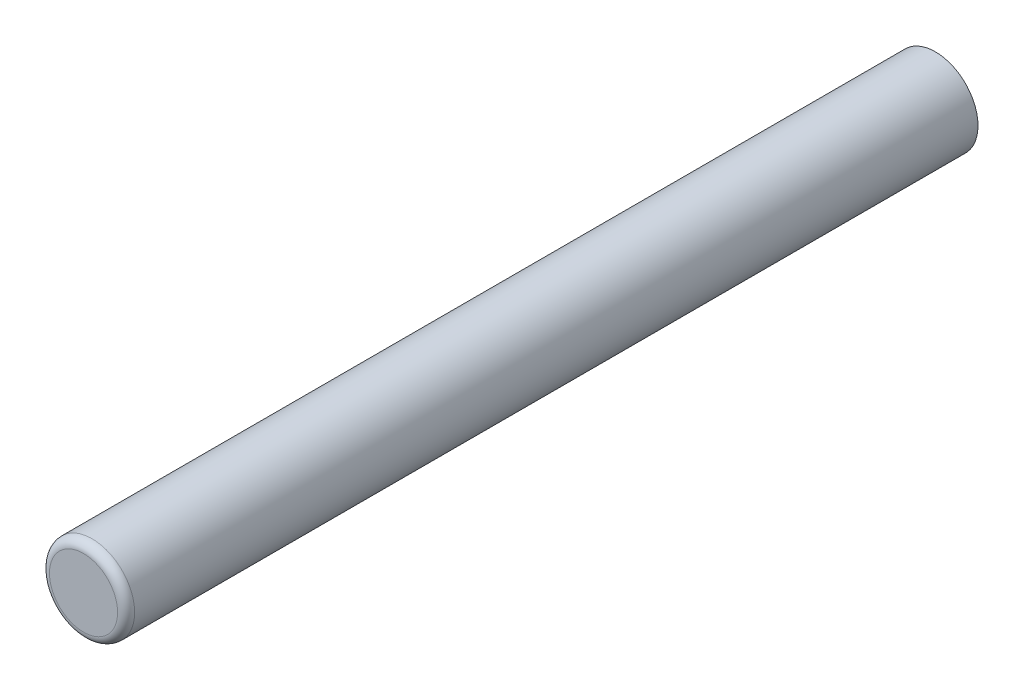
ISO-10303-21;
HEADER;
FILE_DESCRIPTION(('STEP AP214'),'2;1');
FILE_NAME('part.step','',(''),(''),'','','');
FILE_SCHEMA(('AUTOMOTIVE_DESIGN { 1 0 10303 214 1 1 1 1 }'));
ENDSEC;
DATA;
#1=APPLICATION_CONTEXT('core data for automotive mechanical design processes');
#2=APPLICATION_PROTOCOL_DEFINITION('international standard','automotive_design',2000,#1);
#3=PRODUCT_CONTEXT('',#1,'mechanical');
#4=PRODUCT('Part','Part','',(#3));
#5=PRODUCT_RELATED_PRODUCT_CATEGORY('part','',(#4));
#6=PRODUCT_DEFINITION_FORMATION('','',#4);
#7=PRODUCT_DEFINITION_CONTEXT('part definition',#1,'design');
#8=PRODUCT_DEFINITION('design','',#6,#7);
#9=PRODUCT_DEFINITION_SHAPE('','',#8);
#10=(LENGTH_UNIT() NAMED_UNIT(*) SI_UNIT(.MILLI.,.METRE.));
#11=(NAMED_UNIT(*) PLANE_ANGLE_UNIT() SI_UNIT($,.RADIAN.));
#12=(NAMED_UNIT(*) SI_UNIT($,.STERADIAN.) SOLID_ANGLE_UNIT());
#13=UNCERTAINTY_MEASURE_WITH_UNIT(LENGTH_MEASURE(1.E-05),#10,'distance_accuracy_value','');
#14=(GEOMETRIC_REPRESENTATION_CONTEXT(3) GLOBAL_UNCERTAINTY_ASSIGNED_CONTEXT((#13)) GLOBAL_UNIT_ASSIGNED_CONTEXT((#10,
#11,#12)) REPRESENTATION_CONTEXT('',''));
#15=CARTESIAN_POINT('',(0.,0.,0.));
#16=DIRECTION('',(0.,0.,1.));
#17=DIRECTION('',(1.,0.,0.));
#18=AXIS2_PLACEMENT_3D('',#15,#16,#17);
#19=CARTESIAN_POINT('',(0.,0.,63.5));
#20=DIRECTION('',(0.,0.,-1.));
#21=DIRECTION('',(-1.,0.,0.));
#22=AXIS2_PLACEMENT_3D('',#19,#20,#21);
#23=CYLINDRICAL_SURFACE('',#22,3.175);
#24=CARTESIAN_POINT('',(0.,0.,62.865));
#25=DIRECTION('',(0.,0.,1.));
#26=DIRECTION('',(1.,0.,0.));
#27=AXIS2_PLACEMENT_3D('',#24,#25,#26);
#28=CIRCLE('',#27,3.175);
#29=CARTESIAN_POINT('',(3.175,0.,62.865));
#30=VERTEX_POINT('',#29);
#31=EDGE_CURVE('E10',#30,#30,#28,.F.);
#32=ORIENTED_EDGE('',*,*,#31,.T.);
#33=EDGE_LOOP('',(#32));
#34=FACE_BOUND('',#33,.T.);
#35=CARTESIAN_POINT('',(0.,0.,0.));
#36=DIRECTION('',(0.,0.,1.));
#37=DIRECTION('',(1.,0.,0.));
#38=AXIS2_PLACEMENT_3D('',#35,#36,#37);
#39=CIRCLE('',#38,3.175);
#40=CARTESIAN_POINT('',(3.175,0.,0.));
#41=VERTEX_POINT('',#40);
#42=EDGE_CURVE('E45',#41,#41,#39,.T.);
#43=ORIENTED_EDGE('',*,*,#42,.T.);
#44=EDGE_LOOP('',(#43));
#45=FACE_BOUND('',#44,.T.);
#46=ADVANCED_FACE('F32',(#34,#45),#23,.T.);
#47=CARTESIAN_POINT('',(0.,0.,63.5));
#48=DIRECTION('',(0.,0.,1.));
#49=DIRECTION('',(1.,0.,0.));
#50=AXIS2_PLACEMENT_3D('',#47,#48,#49);
#51=PLANE('',#50);
#52=CARTESIAN_POINT('',(0.,0.,63.5));
#53=DIRECTION('',(0.,0.,1.));
#54=DIRECTION('',(1.,0.,0.));
#55=AXIS2_PLACEMENT_3D('',#52,#53,#54);
#56=CIRCLE('',#55,2.54);
#57=CARTESIAN_POINT('',(2.54,0.,63.5));
#58=VERTEX_POINT('',#57);
#59=EDGE_CURVE('E40',#58,#58,#56,.T.);
#60=ORIENTED_EDGE('',*,*,#59,.T.);
#61=EDGE_LOOP('',(#60));
#62=FACE_BOUND('',#61,.T.);
#63=ADVANCED_FACE('F55',(#62),#51,.T.);
#64=CARTESIAN_POINT('',(0.,0.,0.));
#65=DIRECTION('',(0.,0.,1.));
#66=DIRECTION('',(1.,0.,0.));
#67=AXIS2_PLACEMENT_3D('',#64,#65,#66);
#68=PLANE('',#67);
#69=ORIENTED_EDGE('',*,*,#42,.F.);
#70=EDGE_LOOP('',(#69));
#71=FACE_BOUND('',#70,.T.);
#72=ADVANCED_FACE('F53',(#71),#68,.F.);
#73=CARTESIAN_POINT('',(0.,0.,62.865));
#74=DIRECTION('',(0.,0.,1.));
#75=DIRECTION('',(1.,0.,0.));
#76=AXIS2_PLACEMENT_3D('',#73,#74,#75);
#77=TOROIDAL_SURFACE('',#76,2.54,0.635);
#78=ORIENTED_EDGE('',*,*,#31,.F.);
#79=EDGE_LOOP('',(#78));
#80=FACE_BOUND('',#79,.T.);
#81=ORIENTED_EDGE('',*,*,#59,.F.);
#82=EDGE_LOOP('',(#81));
#83=FACE_BOUND('',#82,.T.);
#84=ADVANCED_FACE('F34',(#80,#83),#77,.T.);
#85=CLOSED_SHELL('',(#46,#63,#72,#84));
#86=MANIFOLD_SOLID_BREP('B2',#85);
#87=ADVANCED_BREP_SHAPE_REPRESENTATION('',(#18,#86),#14);
#88=SHAPE_DEFINITION_REPRESENTATION(#9,#87);
ENDSEC;
END-ISO-10303-21;
